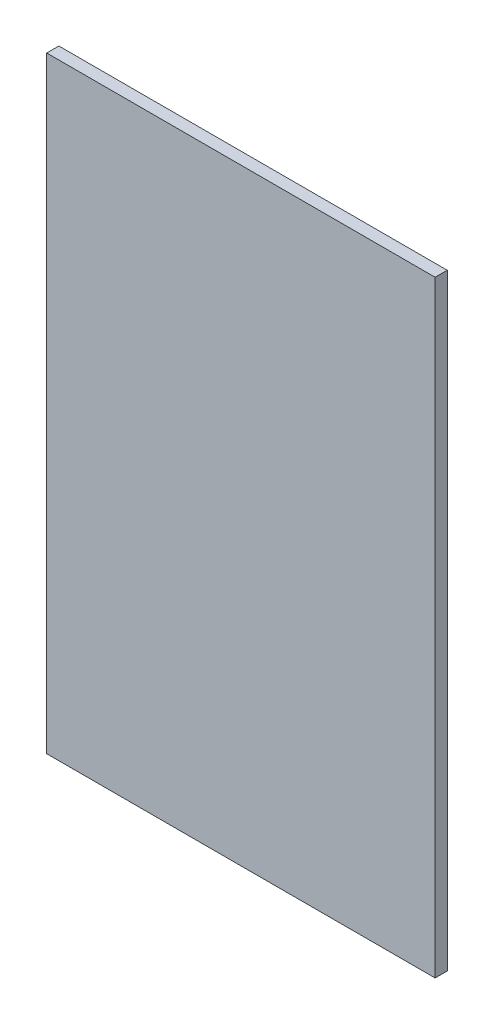
ISO-10303-21;
HEADER;
FILE_DESCRIPTION(('STEP AP214'),'2;1');
FILE_NAME('part.step','',(''),(''),'','','');
FILE_SCHEMA(('AUTOMOTIVE_DESIGN { 1 0 10303 214 1 1 1 1 }'));
ENDSEC;
DATA;
#1=APPLICATION_CONTEXT('core data for automotive mechanical design processes');
#2=APPLICATION_PROTOCOL_DEFINITION('international standard','automotive_design',2000,#1);
#3=PRODUCT_CONTEXT('',#1,'mechanical');
#4=PRODUCT('Part','Part','',(#3));
#5=PRODUCT_RELATED_PRODUCT_CATEGORY('part','',(#4));
#6=PRODUCT_DEFINITION_FORMATION('','',#4);
#7=PRODUCT_DEFINITION_CONTEXT('part definition',#1,'design');
#8=PRODUCT_DEFINITION('design','',#6,#7);
#9=PRODUCT_DEFINITION_SHAPE('','',#8);
#10=(LENGTH_UNIT() NAMED_UNIT(*) SI_UNIT(.MILLI.,.METRE.));
#11=(NAMED_UNIT(*) PLANE_ANGLE_UNIT() SI_UNIT($,.RADIAN.));
#12=(NAMED_UNIT(*) SI_UNIT($,.STERADIAN.) SOLID_ANGLE_UNIT());
#13=UNCERTAINTY_MEASURE_WITH_UNIT(LENGTH_MEASURE(1.E-05),#10,'distance_accuracy_value','');
#14=(GEOMETRIC_REPRESENTATION_CONTEXT(3) GLOBAL_UNCERTAINTY_ASSIGNED_CONTEXT((#13)) GLOBAL_UNIT_ASSIGNED_CONTEXT((#10,
#11,#12)) REPRESENTATION_CONTEXT('',''));
#15=CARTESIAN_POINT('',(0.,0.,0.));
#16=DIRECTION('',(0.,0.,1.));
#17=DIRECTION('',(1.,0.,0.));
#18=AXIS2_PLACEMENT_3D('',#15,#16,#17);
#19=CARTESIAN_POINT('',(0.,0.,6.35));
#20=DIRECTION('',(-1.,0.,0.));
#21=DIRECTION('',(0.,0.,1.));
#22=AXIS2_PLACEMENT_3D('',#19,#20,#21);
#23=PLANE('',#22);
#24=DIRECTION('',(0.,1.,0.));
#25=VECTOR('',#24,1.);
#26=CARTESIAN_POINT('',(0.,0.,0.));
#27=LINE('',#26,#25);
#28=CARTESIAN_POINT('',(0.,0.,0.));
#29=VERTEX_POINT('',#28);
#30=CARTESIAN_POINT('',(0.,317.5,0.));
#31=VERTEX_POINT('',#30);
#32=EDGE_CURVE('E80',#29,#31,#27,.T.);
#33=ORIENTED_EDGE('',*,*,#32,.T.);
#34=DIRECTION('',(0.,0.,-1.));
#35=VECTOR('',#34,1.);
#36=CARTESIAN_POINT('',(0.,317.5,6.35));
#37=LINE('',#36,#35);
#38=CARTESIAN_POINT('',(0.,317.5,6.35));
#39=VERTEX_POINT('',#38);
#40=EDGE_CURVE('E11',#39,#31,#37,.T.);
#41=ORIENTED_EDGE('',*,*,#40,.F.);
#42=DIRECTION('',(0.,1.,0.));
#43=VECTOR('',#42,1.);
#44=CARTESIAN_POINT('',(0.,0.,6.35));
#45=LINE('',#44,#43);
#46=CARTESIAN_POINT('',(0.,0.,6.35));
#47=VERTEX_POINT('',#46);
#48=EDGE_CURVE('E68',#47,#39,#45,.T.);
#49=ORIENTED_EDGE('',*,*,#48,.F.);
#50=DIRECTION('',(0.,0.,-1.));
#51=VECTOR('',#50,1.);
#52=CARTESIAN_POINT('',(0.,0.,6.35));
#53=LINE('',#52,#51);
#54=EDGE_CURVE('E76',#47,#29,#53,.T.);
#55=ORIENTED_EDGE('',*,*,#54,.T.);
#56=EDGE_LOOP('',(#33,#41,#49,#55));
#57=FACE_BOUND('',#56,.T.);
#58=ADVANCED_FACE('F17',(#57),#23,.F.);
#59=CARTESIAN_POINT('',(0.,317.5,6.35));
#60=DIRECTION('',(0.,-1.,0.));
#61=DIRECTION('',(0.,0.,-1.));
#62=AXIS2_PLACEMENT_3D('',#59,#60,#61);
#63=PLANE('',#62);
#64=DIRECTION('',(-1.,0.,0.));
#65=VECTOR('',#64,1.);
#66=CARTESIAN_POINT('',(0.,317.5,0.));
#67=LINE('',#66,#65);
#68=CARTESIAN_POINT('',(-203.2,317.5,0.));
#69=VERTEX_POINT('',#68);
#70=EDGE_CURVE('E72',#31,#69,#67,.T.);
#71=ORIENTED_EDGE('',*,*,#70,.T.);
#72=DIRECTION('',(0.,0.,-1.));
#73=VECTOR('',#72,1.);
#74=CARTESIAN_POINT('',(-203.2,317.5,6.35));
#75=LINE('',#74,#73);
#76=CARTESIAN_POINT('',(-203.2,317.5,6.35));
#77=VERTEX_POINT('',#76);
#78=EDGE_CURVE('E25',#77,#69,#75,.T.);
#79=ORIENTED_EDGE('',*,*,#78,.F.);
#80=DIRECTION('',(-1.,0.,0.));
#81=VECTOR('',#80,1.);
#82=CARTESIAN_POINT('',(0.,317.5,6.35));
#83=LINE('',#82,#81);
#84=EDGE_CURVE('E63',#39,#77,#83,.T.);
#85=ORIENTED_EDGE('',*,*,#84,.F.);
#86=ORIENTED_EDGE('',*,*,#40,.T.);
#87=EDGE_LOOP('',(#71,#79,#85,#86));
#88=FACE_BOUND('',#87,.T.);
#89=ADVANCED_FACE('F71',(#88),#63,.F.);
#90=CARTESIAN_POINT('',(-203.2,0.,6.35));
#91=DIRECTION('',(1.,0.,0.));
#92=DIRECTION('',(0.,0.,-1.));
#93=AXIS2_PLACEMENT_3D('',#90,#91,#92);
#94=PLANE('',#93);
#95=DIRECTION('',(0.,-1.,0.));
#96=VECTOR('',#95,1.);
#97=CARTESIAN_POINT('',(-203.2,0.,0.));
#98=LINE('',#97,#96);
#99=CARTESIAN_POINT('',(-203.2,0.,0.));
#100=VERTEX_POINT('',#99);
#101=EDGE_CURVE('E50',#69,#100,#98,.T.);
#102=ORIENTED_EDGE('',*,*,#101,.T.);
#103=DIRECTION('',(0.,0.,-1.));
#104=VECTOR('',#103,1.);
#105=CARTESIAN_POINT('',(-203.2,0.,6.35));
#106=LINE('',#105,#104);
#107=CARTESIAN_POINT('',(-203.2,0.,6.35));
#108=VERTEX_POINT('',#107);
#109=EDGE_CURVE('E73',#108,#100,#106,.T.);
#110=ORIENTED_EDGE('',*,*,#109,.F.);
#111=DIRECTION('',(0.,-1.,0.));
#112=VECTOR('',#111,1.);
#113=CARTESIAN_POINT('',(-203.2,0.,6.35));
#114=LINE('',#113,#112);
#115=EDGE_CURVE('E66',#77,#108,#114,.T.);
#116=ORIENTED_EDGE('',*,*,#115,.F.);
#117=ORIENTED_EDGE('',*,*,#78,.T.);
#118=EDGE_LOOP('',(#102,#110,#116,#117));
#119=FACE_BOUND('',#118,.T.);
#120=ADVANCED_FACE('F74',(#119),#94,.F.);
#121=CARTESIAN_POINT('',(0.,0.,6.35));
#122=DIRECTION('',(0.,1.,0.));
#123=DIRECTION('',(-1.,0.,0.));
#124=AXIS2_PLACEMENT_3D('',#121,#122,#123);
#125=PLANE('',#124);
#126=DIRECTION('',(1.,0.,0.));
#127=VECTOR('',#126,1.);
#128=CARTESIAN_POINT('',(0.,0.,0.));
#129=LINE('',#128,#127);
#130=EDGE_CURVE('E56',#100,#29,#129,.T.);
#131=ORIENTED_EDGE('',*,*,#130,.T.);
#132=ORIENTED_EDGE('',*,*,#54,.F.);
#133=DIRECTION('',(1.,0.,0.));
#134=VECTOR('',#133,1.);
#135=CARTESIAN_POINT('',(0.,0.,6.35));
#136=LINE('',#135,#134);
#137=EDGE_CURVE('E33',#108,#47,#136,.T.);
#138=ORIENTED_EDGE('',*,*,#137,.F.);
#139=ORIENTED_EDGE('',*,*,#109,.T.);
#140=EDGE_LOOP('',(#131,#132,#138,#139));
#141=FACE_BOUND('',#140,.T.);
#142=ADVANCED_FACE('F87',(#141),#125,.F.);
#143=CARTESIAN_POINT('',(0.,317.5,6.35));
#144=DIRECTION('',(0.,0.,1.));
#145=DIRECTION('',(1.,0.,0.));
#146=AXIS2_PLACEMENT_3D('',#143,#144,#145);
#147=PLANE('',#146);
#148=ORIENTED_EDGE('',*,*,#48,.T.);
#149=ORIENTED_EDGE('',*,*,#84,.T.);
#150=ORIENTED_EDGE('',*,*,#115,.T.);
#151=ORIENTED_EDGE('',*,*,#137,.T.);
#152=EDGE_LOOP('',(#148,#149,#150,#151));
#153=FACE_BOUND('',#152,.T.);
#154=ADVANCED_FACE('F64',(#153),#147,.T.);
#155=CARTESIAN_POINT('',(0.,317.5,0.));
#156=DIRECTION('',(0.,0.,1.));
#157=DIRECTION('',(1.,0.,0.));
#158=AXIS2_PLACEMENT_3D('',#155,#156,#157);
#159=PLANE('',#158);
#160=ORIENTED_EDGE('',*,*,#32,.F.);
#161=ORIENTED_EDGE('',*,*,#130,.F.);
#162=ORIENTED_EDGE('',*,*,#101,.F.);
#163=ORIENTED_EDGE('',*,*,#70,.F.);
#164=EDGE_LOOP('',(#160,#161,#162,#163));
#165=FACE_BOUND('',#164,.T.);
#166=ADVANCED_FACE('F90',(#165),#159,.F.);
#167=CLOSED_SHELL('',(#58,#89,#120,#142,#154,#166));
#168=MANIFOLD_SOLID_BREP('B1',#167);
#169=ADVANCED_BREP_SHAPE_REPRESENTATION('',(#18,#168),#14);
#170=SHAPE_DEFINITION_REPRESENTATION(#9,#169);
ENDSEC;
END-ISO-10303-21;
